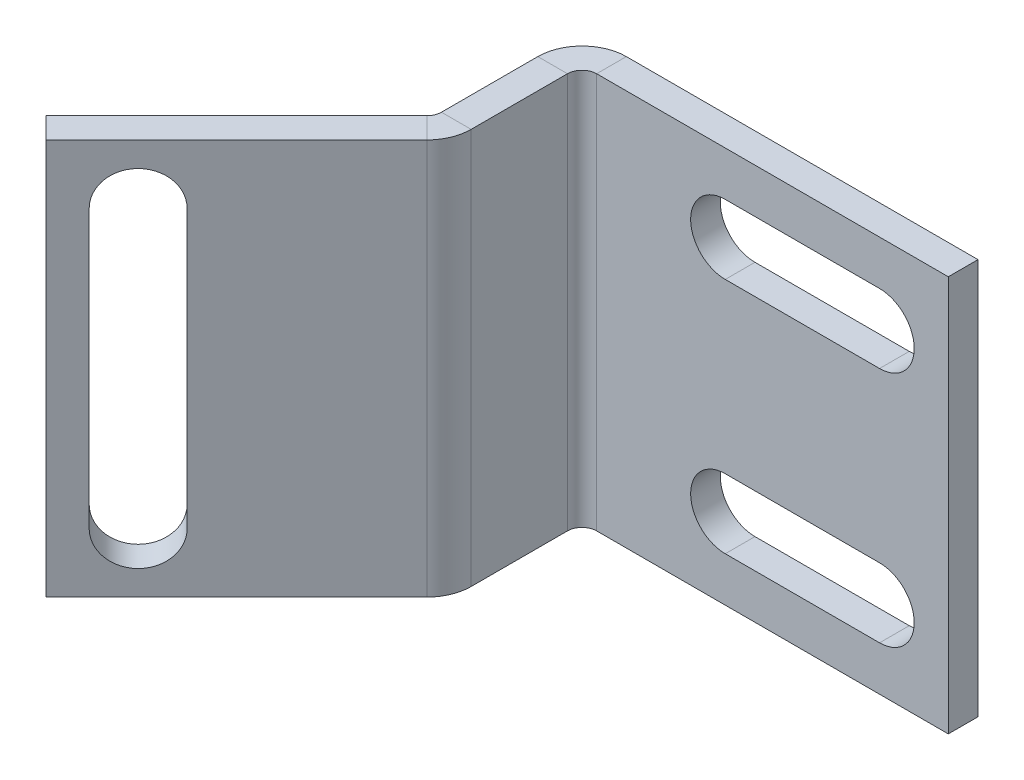
ISO-10303-21;
HEADER;
FILE_DESCRIPTION(('STEP AP214'),'2;1');
FILE_NAME('part.step','',(''),(''),'','','');
FILE_SCHEMA(('AUTOMOTIVE_DESIGN { 1 0 10303 214 1 1 1 1 }'));
ENDSEC;
DATA;
#1=APPLICATION_CONTEXT('core data for automotive mechanical design processes');
#2=APPLICATION_PROTOCOL_DEFINITION('international standard','automotive_design',2000,#1);
#3=PRODUCT_CONTEXT('',#1,'mechanical');
#4=PRODUCT('Part','Part','',(#3));
#5=PRODUCT_RELATED_PRODUCT_CATEGORY('part','',(#4));
#6=PRODUCT_DEFINITION_FORMATION('','',#4);
#7=PRODUCT_DEFINITION_CONTEXT('part definition',#1,'design');
#8=PRODUCT_DEFINITION('design','',#6,#7);
#9=PRODUCT_DEFINITION_SHAPE('','',#8);
#10=(LENGTH_UNIT() NAMED_UNIT(*) SI_UNIT(.MILLI.,.METRE.));
#11=(NAMED_UNIT(*) PLANE_ANGLE_UNIT() SI_UNIT($,.RADIAN.));
#12=(NAMED_UNIT(*) SI_UNIT($,.STERADIAN.) SOLID_ANGLE_UNIT());
#13=UNCERTAINTY_MEASURE_WITH_UNIT(LENGTH_MEASURE(1.E-05),#10,'distance_accuracy_value','');
#14=(GEOMETRIC_REPRESENTATION_CONTEXT(3) GLOBAL_UNCERTAINTY_ASSIGNED_CONTEXT((#13)) GLOBAL_UNIT_ASSIGNED_CONTEXT((#10,
#11,#12)) REPRESENTATION_CONTEXT('',''));
#15=CARTESIAN_POINT('',(0.,0.,0.));
#16=DIRECTION('',(0.,0.,1.));
#17=DIRECTION('',(1.,0.,0.));
#18=AXIS2_PLACEMENT_3D('',#15,#16,#17);
#19=CARTESIAN_POINT('',(-5.80838323353293,3.26347305389222,0.));
#20=DIRECTION('',(0.,-1.,0.));
#21=DIRECTION('',(1.,0.,0.));
#22=AXIS2_PLACEMENT_3D('',#19,#20,#21);
#23=PLANE('',#22);
#24=DIRECTION('',(1.,0.,0.));
#25=VECTOR('',#24,1.);
#26=CARTESIAN_POINT('',(-5.80838323353294,3.26347305389221,5.60356994639633));
#27=LINE('',#26,#25);
#28=CARTESIAN_POINT('',(-5.80838323353294,3.26347305389221,5.60356994639633));
#29=VERTEX_POINT('',#28);
#30=CARTESIAN_POINT('',(-4.30838323353294,3.26347305389221,5.60356994639633));
#31=VERTEX_POINT('',#30);
#32=EDGE_CURVE('E352',#29,#31,#27,.T.);
#33=ORIENTED_EDGE('',*,*,#32,.T.);
#34=DIRECTION('',(0.,0.,1.));
#35=VECTOR('',#34,1.);
#36=CARTESIAN_POINT('',(-4.30838323353293,3.26347305389222,0.));
#37=LINE('',#36,#35);
#38=CARTESIAN_POINT('',(-4.30838323353293,3.26347305389222,0.736599999999997));
#39=VERTEX_POINT('',#38);
#40=EDGE_CURVE('E377',#31,#39,#37,.F.);
#41=ORIENTED_EDGE('',*,*,#40,.T.);
#42=DIRECTION('',(1.,0.,0.));
#43=VECTOR('',#42,1.);
#44=CARTESIAN_POINT('',(-5.80838323353293,3.26347305389222,0.736599999999992));
#45=LINE('',#44,#43);
#46=CARTESIAN_POINT('',(-5.80838323353293,3.26347305389222,0.736599999999992));
#47=VERTEX_POINT('',#46);
#48=EDGE_CURVE('E365',#39,#47,#45,.F.);
#49=ORIENTED_EDGE('',*,*,#48,.T.);
#50=DIRECTION('',(0.,0.,-1.));
#51=VECTOR('',#50,1.);
#52=CARTESIAN_POINT('',(-5.80838323353293,3.26347305389222,0.));
#53=LINE('',#52,#51);
#54=EDGE_CURVE('E372',#29,#47,#53,.T.);
#55=ORIENTED_EDGE('',*,*,#54,.F.);
#56=EDGE_LOOP('',(#33,#41,#49,#55));
#57=FACE_BOUND('',#56,.T.);
#58=ADVANCED_FACE('F77',(#57),#23,.F.);
#59=CARTESIAN_POINT('',(-5.80838323353296,-16.7365269461078,8.03));
#60=DIRECTION('',(0.,1.,0.));
#61=DIRECTION('',(-1.,0.,0.));
#62=AXIS2_PLACEMENT_3D('',#59,#60,#61);
#63=PLANE('',#62);
#64=DIRECTION('',(1.,0.,0.));
#65=VECTOR('',#64,1.);
#66=CARTESIAN_POINT('',(-5.80838323353294,-16.7365269461078,5.60356994639633));
#67=LINE('',#66,#65);
#68=CARTESIAN_POINT('',(-5.80838323353294,-16.7365269461078,5.60356994639633));
#69=VERTEX_POINT('',#68);
#70=CARTESIAN_POINT('',(-4.30838323353295,-16.7365269461078,5.60356994639633));
#71=VERTEX_POINT('',#70);
#72=EDGE_CURVE('E362',#69,#71,#67,.T.);
#73=ORIENTED_EDGE('',*,*,#72,.F.);
#74=DIRECTION('',(0.,0.,1.));
#75=VECTOR('',#74,1.);
#76=CARTESIAN_POINT('',(-5.80838323353293,-16.7365269461078,0.));
#77=LINE('',#76,#75);
#78=CARTESIAN_POINT('',(-5.80838323353293,-16.7365269461078,0.736599999999991));
#79=VERTEX_POINT('',#78);
#80=EDGE_CURVE('E368',#79,#69,#77,.T.);
#81=ORIENTED_EDGE('',*,*,#80,.F.);
#82=DIRECTION('',(1.,0.,0.));
#83=VECTOR('',#82,1.);
#84=CARTESIAN_POINT('',(-4.30838323353293,-16.7365269461078,0.736599999999996));
#85=LINE('',#84,#83);
#86=CARTESIAN_POINT('',(-4.30838323353293,-16.7365269461078,0.736599999999996));
#87=VERTEX_POINT('',#86);
#88=EDGE_CURVE('E382',#87,#79,#85,.F.);
#89=ORIENTED_EDGE('',*,*,#88,.F.);
#90=DIRECTION('',(0.,0.,-1.));
#91=VECTOR('',#90,1.);
#92=CARTESIAN_POINT('',(-4.30838323353295,-16.7365269461078,8.03));
#93=LINE('',#92,#91);
#94=EDGE_CURVE('E374',#87,#71,#93,.F.);
#95=ORIENTED_EDGE('',*,*,#94,.T.);
#96=EDGE_LOOP('',(#73,#81,#89,#95));
#97=FACE_BOUND('',#96,.T.);
#98=ADVANCED_FACE('F498',(#97),#63,.F.);
#99=CARTESIAN_POINT('',(-5.80838323353293,0.,0.));
#100=DIRECTION('',(1.,0.,0.));
#101=DIRECTION('',(0.,0.,-1.));
#102=AXIS2_PLACEMENT_3D('',#99,#100,#101);
#103=PLANE('',#102);
#104=DIRECTION('',(0.,1.,0.));
#105=VECTOR('',#104,1.);
#106=CARTESIAN_POINT('',(-5.80838323353294,3.26347305389222,5.60356994639633));
#107=LINE('',#106,#105);
#108=EDGE_CURVE('E358',#29,#69,#107,.F.);
#109=ORIENTED_EDGE('',*,*,#108,.F.);
#110=ORIENTED_EDGE('',*,*,#54,.T.);
#111=DIRECTION('',(0.,-1.,0.));
#112=VECTOR('',#111,1.);
#113=CARTESIAN_POINT('',(-5.80838323353293,3.26347305389222,0.736599999999992));
#114=LINE('',#113,#112);
#115=EDGE_CURVE('E379',#79,#47,#114,.F.);
#116=ORIENTED_EDGE('',*,*,#115,.F.);
#117=ORIENTED_EDGE('',*,*,#80,.T.);
#118=EDGE_LOOP('',(#109,#110,#116,#117));
#119=FACE_BOUND('',#118,.T.);
#120=ADVANCED_FACE('F493',(#119),#103,.F.);
#121=CARTESIAN_POINT('',(-4.30838323353293,0.,0.));
#122=DIRECTION('',(1.,0.,0.));
#123=DIRECTION('',(0.,0.,-1.));
#124=AXIS2_PLACEMENT_3D('',#121,#122,#123);
#125=PLANE('',#124);
#126=ORIENTED_EDGE('',*,*,#40,.F.);
#127=DIRECTION('',(0.,1.,0.));
#128=VECTOR('',#127,1.);
#129=CARTESIAN_POINT('',(-4.30838323353294,3.26347305389222,5.60356994639633));
#130=LINE('',#129,#128);
#131=EDGE_CURVE('E345',#31,#71,#130,.F.);
#132=ORIENTED_EDGE('',*,*,#131,.T.);
#133=ORIENTED_EDGE('',*,*,#94,.F.);
#134=DIRECTION('',(0.,-1.,0.));
#135=VECTOR('',#134,1.);
#136=CARTESIAN_POINT('',(-4.30838323353293,3.26347305389222,0.736599999999997));
#137=LINE('',#136,#135);
#138=EDGE_CURVE('E385',#39,#87,#137,.T.);
#139=ORIENTED_EDGE('',*,*,#138,.F.);
#140=EDGE_LOOP('',(#126,#132,#133,#139));
#141=FACE_BOUND('',#140,.T.);
#142=ADVANCED_FACE('F505',(#141),#125,.T.);
#143=CARTESIAN_POINT('',(-5.80838323353293,-16.7365269461078,-1.5));
#144=DIRECTION('',(0.,-1.,0.));
#145=DIRECTION('',(0.,0.,-1.));
#146=AXIS2_PLACEMENT_3D('',#143,#144,#145);
#147=PLANE('',#146);
#148=DIRECTION('',(1.,0.,0.));
#149=VECTOR('',#148,1.);
#150=CARTESIAN_POINT('',(-5.80838323353293,-16.7365269461078,0.));
#151=LINE('',#150,#149);
#152=CARTESIAN_POINT('',(-3.57178323353293,-16.7365269461078,0.));
#153=VERTEX_POINT('',#152);
#154=CARTESIAN_POINT('',(14.1916167664671,-16.7365269461078,0.));
#155=VERTEX_POINT('',#154);
#156=EDGE_CURVE('E409',#153,#155,#151,.T.);
#157=ORIENTED_EDGE('',*,*,#156,.F.);
#158=DIRECTION('',(0.,0.,-1.));
#159=VECTOR('',#158,1.);
#160=CARTESIAN_POINT('',(-3.57178323353293,-16.7365269461078,0.));
#161=LINE('',#160,#159);
#162=CARTESIAN_POINT('',(-3.57178323353293,-16.7365269461078,-1.5));
#163=VERTEX_POINT('',#162);
#164=EDGE_CURVE('E395',#153,#163,#161,.T.);
#165=ORIENTED_EDGE('',*,*,#164,.T.);
#166=DIRECTION('',(1.,0.,0.));
#167=VECTOR('',#166,1.);
#168=CARTESIAN_POINT('',(-5.80838323353293,-16.7365269461078,-1.5));
#169=LINE('',#168,#167);
#170=CARTESIAN_POINT('',(14.1916167664671,-16.7365269461078,-1.5));
#171=VERTEX_POINT('',#170);
#172=EDGE_CURVE('E412',#163,#171,#169,.T.);
#173=ORIENTED_EDGE('',*,*,#172,.T.);
#174=DIRECTION('',(0.,0.,1.));
#175=VECTOR('',#174,1.);
#176=CARTESIAN_POINT('',(14.1916167664671,-16.7365269461078,-1.5));
#177=LINE('',#176,#175);
#178=EDGE_CURVE('E421',#171,#155,#177,.T.);
#179=ORIENTED_EDGE('',*,*,#178,.T.);
#180=EDGE_LOOP('',(#157,#165,#173,#179));
#181=FACE_BOUND('',#180,.T.);
#182=ADVANCED_FACE('F79',(#181),#147,.T.);
#183=CARTESIAN_POINT('',(0.,0.,-1.5));
#184=DIRECTION('',(0.,0.,1.));
#185=DIRECTION('',(1.,0.,0.));
#186=AXIS2_PLACEMENT_3D('',#183,#184,#185);
#187=PLANE('',#186);
#188=DIRECTION('',(1.,0.,0.));
#189=VECTOR('',#188,1.);
#190=CARTESIAN_POINT('',(2.92555528243981,1.01347305389222,-1.5));
#191=LINE('',#190,#189);
#192=CARTESIAN_POINT('',(2.92555528243981,1.01347305389222,-1.5));
#193=VERTEX_POINT('',#192);
#194=CARTESIAN_POINT('',(10.7192984695362,1.01347305389221,-1.5));
#195=VERTEX_POINT('',#194);
#196=EDGE_CURVE('E276',#193,#195,#191,.T.);
#197=ORIENTED_EDGE('',*,*,#196,.F.);
#198=CARTESIAN_POINT('',(2.92555528243981,-0.736526946107784,-1.5));
#199=DIRECTION('',(0.,0.,-1.));
#200=DIRECTION('',(-1.,0.,0.));
#201=AXIS2_PLACEMENT_3D('',#198,#199,#200);
#202=CIRCLE('',#201,1.75);
#203=CARTESIAN_POINT('',(2.92555528243981,-2.48652694610778,-1.5));
#204=VERTEX_POINT('',#203);
#205=EDGE_CURVE('E274',#204,#193,#202,.T.);
#206=ORIENTED_EDGE('',*,*,#205,.F.);
#207=DIRECTION('',(-1.,0.,0.));
#208=VECTOR('',#207,1.);
#209=CARTESIAN_POINT('',(2.92555528243981,-2.48652694610778,-1.5));
#210=LINE('',#209,#208);
#211=CARTESIAN_POINT('',(10.7192984695362,-2.48652694610778,-1.5));
#212=VERTEX_POINT('',#211);
#213=EDGE_CURVE('E282',#212,#204,#210,.T.);
#214=ORIENTED_EDGE('',*,*,#213,.F.);
#215=CARTESIAN_POINT('',(10.7192984695362,-0.736526946107785,-1.5));
#216=DIRECTION('',(0.,0.,-1.));
#217=DIRECTION('',(-1.,0.,0.));
#218=AXIS2_PLACEMENT_3D('',#215,#216,#217);
#219=CIRCLE('',#218,1.75);
#220=EDGE_CURVE('E279',#195,#212,#219,.T.);
#221=ORIENTED_EDGE('',*,*,#220,.F.);
#222=EDGE_LOOP('',(#197,#206,#214,#221));
#223=FACE_BOUND('',#222,.T.);
#224=DIRECTION('',(1.,0.,0.));
#225=VECTOR('',#224,1.);
#226=CARTESIAN_POINT('',(2.92555528243981,-10.9865269461078,-1.5));
#227=LINE('',#226,#225);
#228=CARTESIAN_POINT('',(2.92555528243981,-10.9865269461078,-1.5));
#229=VERTEX_POINT('',#228);
#230=CARTESIAN_POINT('',(10.7192984695362,-10.9865269461078,-1.5));
#231=VERTEX_POINT('',#230);
#232=EDGE_CURVE('E296',#229,#231,#227,.T.);
#233=ORIENTED_EDGE('',*,*,#232,.F.);
#234=CARTESIAN_POINT('',(2.92555528243981,-12.7365269461078,-1.5));
#235=DIRECTION('',(0.,0.,-1.));
#236=DIRECTION('',(-1.,0.,0.));
#237=AXIS2_PLACEMENT_3D('',#234,#235,#236);
#238=CIRCLE('',#237,1.75);
#239=CARTESIAN_POINT('',(2.92555528243981,-14.4865269461078,-1.5));
#240=VERTEX_POINT('',#239);
#241=EDGE_CURVE('E288',#240,#229,#238,.T.);
#242=ORIENTED_EDGE('',*,*,#241,.F.);
#243=DIRECTION('',(-1.,0.,0.));
#244=VECTOR('',#243,1.);
#245=CARTESIAN_POINT('',(2.92555528243981,-14.4865269461078,-1.5));
#246=LINE('',#245,#244);
#247=CARTESIAN_POINT('',(10.7192984695362,-14.4865269461078,-1.5));
#248=VERTEX_POINT('',#247);
#249=EDGE_CURVE('E302',#248,#240,#246,.T.);
#250=ORIENTED_EDGE('',*,*,#249,.F.);
#251=CARTESIAN_POINT('',(10.7192984695362,-12.7365269461078,-1.5));
#252=DIRECTION('',(0.,0.,-1.));
#253=DIRECTION('',(-1.,0.,0.));
#254=AXIS2_PLACEMENT_3D('',#251,#252,#253);
#255=CIRCLE('',#254,1.75);
#256=EDGE_CURVE('E299',#231,#248,#255,.T.);
#257=ORIENTED_EDGE('',*,*,#256,.F.);
#258=EDGE_LOOP('',(#233,#242,#250,#257));
#259=FACE_BOUND('',#258,.T.);
#260=DIRECTION('',(0.,-1.,0.));
#261=VECTOR('',#260,1.);
#262=CARTESIAN_POINT('',(-3.57178323353293,-16.7365269461078,-1.5));
#263=LINE('',#262,#261);
#264=CARTESIAN_POINT('',(-3.57178323353293,3.26347305389223,-1.5));
#265=VERTEX_POINT('',#264);
#266=EDGE_CURVE('E389',#163,#265,#263,.F.);
#267=ORIENTED_EDGE('',*,*,#266,.T.);
#268=DIRECTION('',(-1.,0.,0.));
#269=VECTOR('',#268,1.);
#270=CARTESIAN_POINT('',(-5.80838323353293,3.26347305389222,-1.5));
#271=LINE('',#270,#269);
#272=CARTESIAN_POINT('',(14.1916167664671,3.26347305389222,-1.5));
#273=VERTEX_POINT('',#272);
#274=EDGE_CURVE('E418',#273,#265,#271,.T.);
#275=ORIENTED_EDGE('',*,*,#274,.F.);
#276=DIRECTION('',(0.,1.,0.));
#277=VECTOR('',#276,1.);
#278=CARTESIAN_POINT('',(14.1916167664671,3.26347305389222,-1.5));
#279=LINE('',#278,#277);
#280=EDGE_CURVE('E414',#171,#273,#279,.T.);
#281=ORIENTED_EDGE('',*,*,#280,.F.);
#282=ORIENTED_EDGE('',*,*,#172,.F.);
#283=EDGE_LOOP('',(#267,#275,#281,#282));
#284=FACE_BOUND('',#283,.T.);
#285=ADVANCED_FACE('F468',(#223,#259,#284),#187,.F.);
#286=CARTESIAN_POINT('',(0.,0.,0.));
#287=DIRECTION('',(0.,0.,1.));
#288=DIRECTION('',(1.,0.,0.));
#289=AXIS2_PLACEMENT_3D('',#286,#287,#288);
#290=PLANE('',#289);
#291=CARTESIAN_POINT('',(2.92555528243981,-0.736526946107784,0.));
#292=DIRECTION('',(0.,0.,1.));
#293=DIRECTION('',(1.,0.,0.));
#294=AXIS2_PLACEMENT_3D('',#291,#292,#293);
#295=CIRCLE('',#294,1.75);
#296=CARTESIAN_POINT('',(2.92555528243981,1.01347305389222,0.));
#297=VERTEX_POINT('',#296);
#298=CARTESIAN_POINT('',(2.92555528243981,-2.48652694610778,0.));
#299=VERTEX_POINT('',#298);
#300=EDGE_CURVE('E13',#297,#299,#295,.T.);
#301=ORIENTED_EDGE('',*,*,#300,.F.);
#302=DIRECTION('',(-1.,0.,0.));
#303=VECTOR('',#302,1.);
#304=CARTESIAN_POINT('',(0.,1.01347305389222,0.));
#305=LINE('',#304,#303);
#306=CARTESIAN_POINT('',(10.7192984695362,1.01347305389221,0.));
#307=VERTEX_POINT('',#306);
#308=EDGE_CURVE('E441',#307,#297,#305,.T.);
#309=ORIENTED_EDGE('',*,*,#308,.F.);
#310=CARTESIAN_POINT('',(10.7192984695362,-0.736526946107785,0.));
#311=DIRECTION('',(0.,0.,1.));
#312=DIRECTION('',(1.,0.,0.));
#313=AXIS2_PLACEMENT_3D('',#310,#311,#312);
#314=CIRCLE('',#313,1.75);
#315=CARTESIAN_POINT('',(10.7192984695362,-2.48652694610778,0.));
#316=VERTEX_POINT('',#315);
#317=EDGE_CURVE('E443',#316,#307,#314,.T.);
#318=ORIENTED_EDGE('',*,*,#317,.F.);
#319=DIRECTION('',(1.,0.,0.));
#320=VECTOR('',#319,1.);
#321=CARTESIAN_POINT('',(0.,-2.48652694610778,0.));
#322=LINE('',#321,#320);
#323=EDGE_CURVE('E85',#299,#316,#322,.T.);
#324=ORIENTED_EDGE('',*,*,#323,.F.);
#325=EDGE_LOOP('',(#301,#309,#318,#324));
#326=FACE_BOUND('',#325,.T.);
#327=CARTESIAN_POINT('',(2.92555528243981,-12.7365269461078,0.));
#328=DIRECTION('',(0.,0.,1.));
#329=DIRECTION('',(1.,0.,0.));
#330=AXIS2_PLACEMENT_3D('',#327,#328,#329);
#331=CIRCLE('',#330,1.75);
#332=CARTESIAN_POINT('',(2.92555528243981,-10.9865269461078,0.));
#333=VERTEX_POINT('',#332);
#334=CARTESIAN_POINT('',(2.92555528243981,-14.4865269461078,0.));
#335=VERTEX_POINT('',#334);
#336=EDGE_CURVE('E439',#333,#335,#331,.T.);
#337=ORIENTED_EDGE('',*,*,#336,.F.);
#338=DIRECTION('',(-1.,0.,0.));
#339=VECTOR('',#338,1.);
#340=CARTESIAN_POINT('',(0.,-10.9865269461078,0.));
#341=LINE('',#340,#339);
#342=CARTESIAN_POINT('',(10.7192984695362,-10.9865269461078,0.));
#343=VERTEX_POINT('',#342);
#344=EDGE_CURVE('E430',#343,#333,#341,.T.);
#345=ORIENTED_EDGE('',*,*,#344,.F.);
#346=CARTESIAN_POINT('',(10.7192984695362,-12.7365269461078,0.));
#347=DIRECTION('',(0.,0.,1.));
#348=DIRECTION('',(1.,0.,0.));
#349=AXIS2_PLACEMENT_3D('',#346,#347,#348);
#350=CIRCLE('',#349,1.75);
#351=CARTESIAN_POINT('',(10.7192984695362,-14.4865269461078,0.));
#352=VERTEX_POINT('',#351);
#353=EDGE_CURVE('E434',#352,#343,#350,.T.);
#354=ORIENTED_EDGE('',*,*,#353,.F.);
#355=DIRECTION('',(1.,0.,0.));
#356=VECTOR('',#355,1.);
#357=CARTESIAN_POINT('',(0.,-14.4865269461078,0.));
#358=LINE('',#357,#356);
#359=EDGE_CURVE('E437',#335,#352,#358,.T.);
#360=ORIENTED_EDGE('',*,*,#359,.F.);
#361=EDGE_LOOP('',(#337,#345,#354,#360));
#362=FACE_BOUND('',#361,.T.);
#363=DIRECTION('',(-1.,0.,0.));
#364=VECTOR('',#363,1.);
#365=CARTESIAN_POINT('',(-5.80838323353293,3.26347305389222,0.));
#366=LINE('',#365,#364);
#367=CARTESIAN_POINT('',(14.1916167664671,3.26347305389222,0.));
#368=VERTEX_POINT('',#367);
#369=CARTESIAN_POINT('',(-3.57178323353293,3.26347305389222,0.));
#370=VERTEX_POINT('',#369);
#371=EDGE_CURVE('E415',#368,#370,#366,.T.);
#372=ORIENTED_EDGE('',*,*,#371,.T.);
#373=DIRECTION('',(0.,-1.,0.));
#374=VECTOR('',#373,1.);
#375=CARTESIAN_POINT('',(-3.57178323353293,-16.7365269461078,0.));
#376=LINE('',#375,#374);
#377=EDGE_CURVE('E401',#153,#370,#376,.F.);
#378=ORIENTED_EDGE('',*,*,#377,.F.);
#379=ORIENTED_EDGE('',*,*,#156,.T.);
#380=DIRECTION('',(0.,1.,0.));
#381=VECTOR('',#380,1.);
#382=CARTESIAN_POINT('',(14.1916167664671,3.26347305389222,0.));
#383=LINE('',#382,#381);
#384=EDGE_CURVE('E423',#155,#368,#383,.T.);
#385=ORIENTED_EDGE('',*,*,#384,.T.);
#386=EDGE_LOOP('',(#372,#378,#379,#385));
#387=FACE_BOUND('',#386,.T.);
#388=ADVANCED_FACE('F458',(#326,#362,#387),#290,.T.);
#389=CARTESIAN_POINT('',(-5.80838323353293,3.26347305389222,-1.5));
#390=DIRECTION('',(0.,1.,0.));
#391=DIRECTION('',(0.,0.,1.));
#392=AXIS2_PLACEMENT_3D('',#389,#390,#391);
#393=PLANE('',#392);
#394=DIRECTION('',(0.,0.,-1.));
#395=VECTOR('',#394,1.);
#396=CARTESIAN_POINT('',(-3.57178323353293,3.26347305389222,0.));
#397=LINE('',#396,#395);
#398=EDGE_CURVE('E406',#370,#265,#397,.T.);
#399=ORIENTED_EDGE('',*,*,#398,.F.);
#400=ORIENTED_EDGE('',*,*,#371,.F.);
#401=DIRECTION('',(0.,0.,1.));
#402=VECTOR('',#401,1.);
#403=CARTESIAN_POINT('',(14.1916167664671,3.26347305389222,-1.5));
#404=LINE('',#403,#402);
#405=EDGE_CURVE('E428',#273,#368,#404,.T.);
#406=ORIENTED_EDGE('',*,*,#405,.F.);
#407=ORIENTED_EDGE('',*,*,#274,.T.);
#408=EDGE_LOOP('',(#399,#400,#406,#407));
#409=FACE_BOUND('',#408,.T.);
#410=ADVANCED_FACE('F482',(#409),#393,.T.);
#411=CARTESIAN_POINT('',(14.1916167664671,3.26347305389222,-1.5));
#412=DIRECTION('',(1.,0.,0.));
#413=DIRECTION('',(0.,1.,0.));
#414=AXIS2_PLACEMENT_3D('',#411,#412,#413);
#415=PLANE('',#414);
#416=ORIENTED_EDGE('',*,*,#384,.F.);
#417=ORIENTED_EDGE('',*,*,#178,.F.);
#418=ORIENTED_EDGE('',*,*,#280,.T.);
#419=ORIENTED_EDGE('',*,*,#405,.T.);
#420=EDGE_LOOP('',(#416,#417,#418,#419));
#421=FACE_BOUND('',#420,.T.);
#422=ADVANCED_FACE('F533',(#421),#415,.T.);
#423=CARTESIAN_POINT('',(-3.57178323353293,3.26347305389222,0.7366));
#424=DIRECTION('',(0.,1.,0.));
#425=DIRECTION('',(0.,0.,1.));
#426=AXIS2_PLACEMENT_3D('',#423,#424,#425);
#427=PLANE('',#426);
#428=ORIENTED_EDGE('',*,*,#48,.F.);
#429=CARTESIAN_POINT('',(-3.57178323353293,3.26347305389222,0.7366));
#430=DIRECTION('',(0.,-1.,0.));
#431=DIRECTION('',(0.,0.,-1.));
#432=AXIS2_PLACEMENT_3D('',#429,#430,#431);
#433=CIRCLE('',#432,0.7366);
#434=EDGE_CURVE('E398',#370,#39,#433,.F.);
#435=ORIENTED_EDGE('',*,*,#434,.F.);
#436=ORIENTED_EDGE('',*,*,#398,.T.);
#437=CARTESIAN_POINT('',(-3.57178323353293,3.26347305389222,0.7366));
#438=DIRECTION('',(0.,-1.,0.));
#439=DIRECTION('',(0.,0.,-1.));
#440=AXIS2_PLACEMENT_3D('',#437,#438,#439);
#441=CIRCLE('',#440,2.2366);
#442=EDGE_CURVE('E391',#265,#47,#441,.F.);
#443=ORIENTED_EDGE('',*,*,#442,.T.);
#444=EDGE_LOOP('',(#428,#435,#436,#443));
#445=FACE_BOUND('',#444,.T.);
#446=ADVANCED_FACE('F487',(#445),#427,.T.);
#447=CARTESIAN_POINT('',(-3.57178323353293,-16.7365269461078,0.736599999999998));
#448=DIRECTION('',(0.,1.,0.));
#449=DIRECTION('',(0.,0.,1.));
#450=AXIS2_PLACEMENT_3D('',#447,#448,#449);
#451=PLANE('',#450);
#452=CARTESIAN_POINT('',(-3.57178323353293,-16.7365269461078,0.736599999999998));
#453=DIRECTION('',(0.,-1.,0.));
#454=DIRECTION('',(0.,0.,-1.));
#455=AXIS2_PLACEMENT_3D('',#452,#453,#454);
#456=CIRCLE('',#455,0.7366);
#457=EDGE_CURVE('E371',#87,#153,#456,.T.);
#458=ORIENTED_EDGE('',*,*,#457,.F.);
#459=ORIENTED_EDGE('',*,*,#88,.T.);
#460=CARTESIAN_POINT('',(-3.57178323353293,-16.7365269461078,0.736599999999998));
#461=DIRECTION('',(0.,-1.,0.));
#462=DIRECTION('',(0.,0.,-1.));
#463=AXIS2_PLACEMENT_3D('',#460,#461,#462);
#464=CIRCLE('',#463,2.2366);
#465=EDGE_CURVE('E392',#79,#163,#464,.T.);
#466=ORIENTED_EDGE('',*,*,#465,.T.);
#467=ORIENTED_EDGE('',*,*,#164,.F.);
#468=EDGE_LOOP('',(#458,#459,#466,#467));
#469=FACE_BOUND('',#468,.T.);
#470=ADVANCED_FACE('F525',(#469),#451,.F.);
#471=CARTESIAN_POINT('',(-3.57178323353293,-16.7365269461078,0.736599999999998));
#472=DIRECTION('',(0.,-1.,0.));
#473=DIRECTION('',(-1.,0.,0.));
#474=AXIS2_PLACEMENT_3D('',#471,#472,#473);
#475=CYLINDRICAL_SURFACE('',#474,2.2366);
#476=ORIENTED_EDGE('',*,*,#266,.F.);
#477=ORIENTED_EDGE('',*,*,#465,.F.);
#478=ORIENTED_EDGE('',*,*,#115,.T.);
#479=ORIENTED_EDGE('',*,*,#442,.F.);
#480=EDGE_LOOP('',(#476,#477,#478,#479));
#481=FACE_BOUND('',#480,.T.);
#482=ADVANCED_FACE('F488',(#481),#475,.T.);
#483=CARTESIAN_POINT('',(-3.57178323353293,-16.7365269461078,0.736599999999998));
#484=DIRECTION('',(0.,-1.,0.));
#485=DIRECTION('',(-1.,0.,0.));
#486=AXIS2_PLACEMENT_3D('',#483,#484,#485);
#487=CYLINDRICAL_SURFACE('',#486,0.7366);
#488=ORIENTED_EDGE('',*,*,#377,.T.);
#489=ORIENTED_EDGE('',*,*,#434,.T.);
#490=ORIENTED_EDGE('',*,*,#138,.T.);
#491=ORIENTED_EDGE('',*,*,#457,.T.);
#492=EDGE_LOOP('',(#488,#489,#490,#491));
#493=FACE_BOUND('',#492,.T.);
#494=ADVANCED_FACE('F516',(#493),#487,.F.);
#495=CARTESIAN_POINT('',(-6.54498323353294,-16.7365269461078,5.60356994639632));
#496=DIRECTION('',(0.,-1.,0.));
#497=DIRECTION('',(0.,0.,-1.));
#498=AXIS2_PLACEMENT_3D('',#495,#496,#497);
#499=PLANE('',#498);
#500=DIRECTION('',(-0.707106781186549,0.,-0.707106781186546));
#501=VECTOR('',#500,1.);
#502=CARTESIAN_POINT('',(-4.96346820673111,-16.7365269461078,7.18508497319815));
#503=LINE('',#502,#501);
#504=CARTESIAN_POINT('',(-6.02412837851093,-16.7365269461078,6.12442480141833));
#505=VERTEX_POINT('',#504);
#506=CARTESIAN_POINT('',(-4.96346820673111,-16.7365269461078,7.18508497319815));
#507=VERTEX_POINT('',#506);
#508=EDGE_CURVE('E308',#505,#507,#503,.F.);
#509=ORIENTED_EDGE('',*,*,#508,.F.);
#510=CARTESIAN_POINT('',(-6.54498323353294,-16.7365269461078,5.60356994639632));
#511=DIRECTION('',(0.,1.,0.));
#512=DIRECTION('',(0.,0.,1.));
#513=AXIS2_PLACEMENT_3D('',#510,#511,#512);
#514=CIRCLE('',#513,0.7366);
#515=EDGE_CURVE('E355',#69,#505,#514,.F.);
#516=ORIENTED_EDGE('',*,*,#515,.F.);
#517=ORIENTED_EDGE('',*,*,#72,.T.);
#518=CARTESIAN_POINT('',(-6.54498323353294,-16.7365269461078,5.60356994639632));
#519=DIRECTION('',(0.,1.,0.));
#520=DIRECTION('',(0.,0.,1.));
#521=AXIS2_PLACEMENT_3D('',#518,#519,#520);
#522=CIRCLE('',#521,2.2366);
#523=EDGE_CURVE('E348',#71,#507,#522,.F.);
#524=ORIENTED_EDGE('',*,*,#523,.T.);
#525=EDGE_LOOP('',(#509,#516,#517,#524));
#526=FACE_BOUND('',#525,.T.);
#527=ADVANCED_FACE('F502',(#526),#499,.T.);
#528=CARTESIAN_POINT('',(-6.54498323353294,3.26347305389221,5.60356994639632));
#529=DIRECTION('',(0.,-1.,0.));
#530=DIRECTION('',(0.,0.,-1.));
#531=AXIS2_PLACEMENT_3D('',#528,#529,#530);
#532=PLANE('',#531);
#533=CARTESIAN_POINT('',(-6.54498323353294,3.26347305389221,5.60356994639632));
#534=DIRECTION('',(0.,1.,0.));
#535=DIRECTION('',(0.,0.,1.));
#536=AXIS2_PLACEMENT_3D('',#533,#534,#535);
#537=CIRCLE('',#536,0.7366);
#538=CARTESIAN_POINT('',(-6.02412837851093,3.26347305389221,6.12442480141833));
#539=VERTEX_POINT('',#538);
#540=EDGE_CURVE('E318',#539,#29,#537,.T.);
#541=ORIENTED_EDGE('',*,*,#540,.F.);
#542=DIRECTION('',(-0.707106781186549,0.,-0.707106781186546));
#543=VECTOR('',#542,1.);
#544=CARTESIAN_POINT('',(-6.02412837851093,3.26347305389222,6.12442480141833));
#545=LINE('',#544,#543);
#546=CARTESIAN_POINT('',(-4.96346820673111,3.26347305389222,7.18508497319815));
#547=VERTEX_POINT('',#546);
#548=EDGE_CURVE('E338',#539,#547,#545,.F.);
#549=ORIENTED_EDGE('',*,*,#548,.T.);
#550=CARTESIAN_POINT('',(-6.54498323353294,3.26347305389221,5.60356994639632));
#551=DIRECTION('',(0.,1.,0.));
#552=DIRECTION('',(0.,0.,1.));
#553=AXIS2_PLACEMENT_3D('',#550,#551,#552);
#554=CIRCLE('',#553,2.2366);
#555=EDGE_CURVE('E349',#547,#31,#554,.T.);
#556=ORIENTED_EDGE('',*,*,#555,.T.);
#557=ORIENTED_EDGE('',*,*,#32,.F.);
#558=EDGE_LOOP('',(#541,#549,#556,#557));
#559=FACE_BOUND('',#558,.T.);
#560=ADVANCED_FACE('F511',(#559),#532,.F.);
#561=CARTESIAN_POINT('',(-6.54498323353294,3.26347305389222,5.60356994639632));
#562=DIRECTION('',(0.,1.,0.));
#563=DIRECTION('',(0.707106781186549,0.,0.707106781186546));
#564=AXIS2_PLACEMENT_3D('',#561,#562,#563);
#565=CYLINDRICAL_SURFACE('',#564,2.2366);
#566=ORIENTED_EDGE('',*,*,#131,.F.);
#567=ORIENTED_EDGE('',*,*,#555,.F.);
#568=DIRECTION('',(0.,1.,0.));
#569=VECTOR('',#568,1.);
#570=CARTESIAN_POINT('',(-4.96346820673111,-16.7365269461078,7.18508497319815));
#571=LINE('',#570,#569);
#572=EDGE_CURVE('E336',#547,#507,#571,.F.);
#573=ORIENTED_EDGE('',*,*,#572,.T.);
#574=ORIENTED_EDGE('',*,*,#523,.F.);
#575=EDGE_LOOP('',(#566,#567,#573,#574));
#576=FACE_BOUND('',#575,.T.);
#577=ADVANCED_FACE('F508',(#576),#565,.T.);
#578=CARTESIAN_POINT('',(-6.54498323353294,3.26347305389222,5.60356994639632));
#579=DIRECTION('',(0.,1.,0.));
#580=DIRECTION('',(0.707106781186549,0.,0.707106781186546));
#581=AXIS2_PLACEMENT_3D('',#578,#579,#580);
#582=CYLINDRICAL_SURFACE('',#581,0.7366);
#583=ORIENTED_EDGE('',*,*,#108,.T.);
#584=ORIENTED_EDGE('',*,*,#515,.T.);
#585=DIRECTION('',(0.,1.,0.));
#586=VECTOR('',#585,1.);
#587=CARTESIAN_POINT('',(-6.02412837851093,-16.7365269461078,6.12442480141833));
#588=LINE('',#587,#586);
#589=EDGE_CURVE('E341',#505,#539,#588,.T.);
#590=ORIENTED_EDGE('',*,*,#589,.T.);
#591=ORIENTED_EDGE('',*,*,#540,.T.);
#592=EDGE_LOOP('',(#583,#584,#590,#591));
#593=FACE_BOUND('',#592,.T.);
#594=ADVANCED_FACE('F553',(#593),#582,.F.);
#595=CARTESIAN_POINT('',(-4.74772306175312,-16.7365269461078,6.96933982822016));
#596=DIRECTION('',(0.,1.,0.));
#597=DIRECTION('',(-1.,0.,0.));
#598=AXIS2_PLACEMENT_3D('',#595,#596,#597);
#599=PLANE('',#598);
#600=ORIENTED_EDGE('',*,*,#508,.T.);
#601=DIRECTION('',(0.707106781186546,0.,-0.707106781186549));
#602=VECTOR('',#601,1.);
#603=CARTESIAN_POINT('',(2.17146855501334,-16.7365269461078,0.0501482114536756));
#604=LINE('',#603,#602);
#605=CARTESIAN_POINT('',(-14.5826447641735,-16.7365269461078,16.8042615306405));
#606=VERTEX_POINT('',#605);
#607=EDGE_CURVE('E326',#606,#507,#604,.T.);
#608=ORIENTED_EDGE('',*,*,#607,.F.);
#609=DIRECTION('',(-0.707106781186549,0.,-0.707106781186546));
#610=VECTOR('',#609,1.);
#611=CARTESIAN_POINT('',(-14.5826447641735,-16.7365269461078,16.8042615306405));
#612=LINE('',#611,#610);
#613=CARTESIAN_POINT('',(-15.6433049359533,-16.7365269461078,15.7436013588607));
#614=VERTEX_POINT('',#613);
#615=EDGE_CURVE('E319',#606,#614,#612,.T.);
#616=ORIENTED_EDGE('',*,*,#615,.T.);
#617=DIRECTION('',(-0.707106781186546,0.,0.707106781186549));
#618=VECTOR('',#617,1.);
#619=CARTESIAN_POINT('',(-5.80838323353295,-16.7365269461078,5.90867965644035));
#620=LINE('',#619,#618);
#621=EDGE_CURVE('E333',#614,#505,#620,.F.);
#622=ORIENTED_EDGE('',*,*,#621,.T.);
#623=EDGE_LOOP('',(#600,#608,#616,#622));
#624=FACE_BOUND('',#623,.T.);
#625=ADVANCED_FACE('F659',(#624),#599,.F.);
#626=CARTESIAN_POINT('',(-14.5826447641735,3.26347305389222,16.8042615306405));
#627=DIRECTION('',(0.,-1.,0.));
#628=DIRECTION('',(1.,0.,0.));
#629=AXIS2_PLACEMENT_3D('',#626,#627,#628);
#630=PLANE('',#629);
#631=ORIENTED_EDGE('',*,*,#548,.F.);
#632=DIRECTION('',(0.707106781186546,0.,-0.707106781186549));
#633=VECTOR('',#632,1.);
#634=CARTESIAN_POINT('',(-15.6433049359533,3.26347305389222,15.7436013588607));
#635=LINE('',#634,#633);
#636=CARTESIAN_POINT('',(-15.6433049359533,3.26347305389222,15.7436013588607));
#637=VERTEX_POINT('',#636);
#638=EDGE_CURVE('E331',#539,#637,#635,.F.);
#639=ORIENTED_EDGE('',*,*,#638,.T.);
#640=DIRECTION('',(-0.707106781186549,0.,-0.707106781186546));
#641=VECTOR('',#640,1.);
#642=CARTESIAN_POINT('',(-14.5826447641735,3.26347305389222,16.8042615306405));
#643=LINE('',#642,#641);
#644=CARTESIAN_POINT('',(-14.5826447641735,3.26347305389222,16.8042615306405));
#645=VERTEX_POINT('',#644);
#646=EDGE_CURVE('E315',#645,#637,#643,.T.);
#647=ORIENTED_EDGE('',*,*,#646,.F.);
#648=DIRECTION('',(-0.707106781186546,0.,0.707106781186549));
#649=VECTOR('',#648,1.);
#650=CARTESIAN_POINT('',(2.17146855501334,3.26347305389222,0.0501482114536757));
#651=LINE('',#650,#649);
#652=EDGE_CURVE('E324',#547,#645,#651,.T.);
#653=ORIENTED_EDGE('',*,*,#652,.F.);
#654=EDGE_LOOP('',(#631,#639,#647,#653));
#655=FACE_BOUND('',#654,.T.);
#656=ADVANCED_FACE('F669',(#655),#630,.F.);
#657=CARTESIAN_POINT('',(2.17146855501334,0.,0.0501482114536756));
#658=DIRECTION('',(-0.707106781186549,0.,-0.707106781186546));
#659=DIRECTION('',(-0.707106781186546,0.,0.707106781186549));
#660=AXIS2_PLACEMENT_3D('',#657,#658,#659);
#661=PLANE('',#660);
#662=DIRECTION('',(0.,-1.,0.));
#663=VECTOR('',#662,1.);
#664=CARTESIAN_POINT('',(-11.0177869538173,0.,13.2394037202844));
#665=LINE('',#664,#663);
#666=CARTESIAN_POINT('',(-11.0177869538173,0.263473053892216,13.2394037202844));
#667=VERTEX_POINT('',#666);
#668=CARTESIAN_POINT('',(-11.0177869538173,-13.7365269461078,13.2394037202844));
#669=VERTEX_POINT('',#668);
#670=EDGE_CURVE('E268',#667,#669,#665,.T.);
#671=ORIENTED_EDGE('',*,*,#670,.T.);
#672=CARTESIAN_POINT('',(-12.2552238208938,-13.7365269461078,14.4768405873608));
#673=DIRECTION('',(-0.707106781186549,0.,-0.707106781186546));
#674=DIRECTION('',(-0.707106781186546,0.,0.707106781186549));
#675=AXIS2_PLACEMENT_3D('',#672,#673,#674);
#676=CIRCLE('',#675,1.75);
#677=CARTESIAN_POINT('',(-13.4926606879702,-13.7365269461078,15.7142774544373));
#678=VERTEX_POINT('',#677);
#679=EDGE_CURVE('E271',#669,#678,#676,.T.);
#680=ORIENTED_EDGE('',*,*,#679,.T.);
#681=DIRECTION('',(0.,1.,0.));
#682=VECTOR('',#681,1.);
#683=CARTESIAN_POINT('',(-13.4926606879702,0.,15.7142774544373));
#684=LINE('',#683,#682);
#685=CARTESIAN_POINT('',(-13.4926606879702,0.263473053892216,15.7142774544373));
#686=VERTEX_POINT('',#685);
#687=EDGE_CURVE('E263',#678,#686,#684,.T.);
#688=ORIENTED_EDGE('',*,*,#687,.T.);
#689=CARTESIAN_POINT('',(-12.2552238208938,0.263473053892216,14.4768405873608));
#690=DIRECTION('',(-0.707106781186549,0.,-0.707106781186546));
#691=DIRECTION('',(-0.707106781186546,0.,0.707106781186549));
#692=AXIS2_PLACEMENT_3D('',#689,#690,#691);
#693=CIRCLE('',#692,1.75);
#694=EDGE_CURVE('E243',#686,#667,#693,.T.);
#695=ORIENTED_EDGE('',*,*,#694,.T.);
#696=EDGE_LOOP('',(#671,#680,#688,#695));
#697=FACE_BOUND('',#696,.T.);
#698=ORIENTED_EDGE('',*,*,#572,.F.);
#699=ORIENTED_EDGE('',*,*,#652,.T.);
#700=DIRECTION('',(0.,-1.,0.));
#701=VECTOR('',#700,1.);
#702=CARTESIAN_POINT('',(-14.5826447641735,0.,16.8042615306405));
#703=LINE('',#702,#701);
#704=EDGE_CURVE('E322',#645,#606,#703,.T.);
#705=ORIENTED_EDGE('',*,*,#704,.T.);
#706=ORIENTED_EDGE('',*,*,#607,.T.);
#707=EDGE_LOOP('',(#698,#699,#705,#706));
#708=FACE_BOUND('',#707,.T.);
#709=ADVANCED_FACE('F679',(#697,#708),#661,.F.);
#710=CARTESIAN_POINT('',(1.11080838323352,0.,-1.01051196032614));
#711=DIRECTION('',(-0.707106781186549,0.,-0.707106781186546));
#712=DIRECTION('',(-0.707106781186546,0.,0.707106781186549));
#713=AXIS2_PLACEMENT_3D('',#710,#711,#712);
#714=PLANE('',#713);
#715=CARTESIAN_POINT('',(-13.3158839926736,-13.7365269461078,13.416180415581));
#716=DIRECTION('',(-0.707106781186549,0.,-0.707106781186546));
#717=DIRECTION('',(-0.707106781186546,0.,0.707106781186549));
#718=AXIS2_PLACEMENT_3D('',#715,#716,#717);
#719=CIRCLE('',#718,1.75);
#720=CARTESIAN_POINT('',(-12.0784471255971,-13.7365269461078,12.1787435485046));
#721=VERTEX_POINT('',#720);
#722=CARTESIAN_POINT('',(-14.55332085975,-13.7365269461078,14.6536172826575));
#723=VERTEX_POINT('',#722);
#724=EDGE_CURVE('E100',#721,#723,#719,.T.);
#725=ORIENTED_EDGE('',*,*,#724,.F.);
#726=DIRECTION('',(0.,-1.,0.));
#727=VECTOR('',#726,1.);
#728=CARTESIAN_POINT('',(-12.0784471255971,-13.7365269461078,12.1787435485046));
#729=LINE('',#728,#727);
#730=CARTESIAN_POINT('',(-12.0784471255971,0.263473053892216,12.1787435485046));
#731=VERTEX_POINT('',#730);
#732=EDGE_CURVE('E256',#731,#721,#729,.T.);
#733=ORIENTED_EDGE('',*,*,#732,.F.);
#734=CARTESIAN_POINT('',(-13.3158839926736,0.263473053892216,13.416180415581));
#735=DIRECTION('',(-0.707106781186549,0.,-0.707106781186546));
#736=DIRECTION('',(-0.707106781186546,0.,0.707106781186549));
#737=AXIS2_PLACEMENT_3D('',#734,#735,#736);
#738=CIRCLE('',#737,1.75);
#739=CARTESIAN_POINT('',(-14.55332085975,0.263473053892216,14.6536172826575));
#740=VERTEX_POINT('',#739);
#741=EDGE_CURVE('E240',#740,#731,#738,.T.);
#742=ORIENTED_EDGE('',*,*,#741,.F.);
#743=DIRECTION('',(0.,1.,0.));
#744=VECTOR('',#743,1.);
#745=CARTESIAN_POINT('',(-14.5533208597501,-13.7365269461078,14.6536172826575));
#746=LINE('',#745,#744);
#747=EDGE_CURVE('E249',#723,#740,#746,.T.);
#748=ORIENTED_EDGE('',*,*,#747,.F.);
#749=EDGE_LOOP('',(#725,#733,#742,#748));
#750=FACE_BOUND('',#749,.T.);
#751=ORIENTED_EDGE('',*,*,#638,.F.);
#752=ORIENTED_EDGE('',*,*,#589,.F.);
#753=ORIENTED_EDGE('',*,*,#621,.F.);
#754=DIRECTION('',(0.,1.,0.));
#755=VECTOR('',#754,1.);
#756=CARTESIAN_POINT('',(-15.6433049359533,-16.7365269461078,15.7436013588607));
#757=LINE('',#756,#755);
#758=EDGE_CURVE('E329',#637,#614,#757,.F.);
#759=ORIENTED_EDGE('',*,*,#758,.F.);
#760=EDGE_LOOP('',(#751,#752,#753,#759));
#761=FACE_BOUND('',#760,.T.);
#762=ADVANCED_FACE('F253',(#750,#761),#714,.T.);
#763=CARTESIAN_POINT('',(-14.5826447641735,-16.7365269461078,16.8042615306405));
#764=DIRECTION('',(0.707106781186546,0.,-0.707106781186549));
#765=DIRECTION('',(-0.707106781186549,0.,-0.707106781186546));
#766=AXIS2_PLACEMENT_3D('',#763,#764,#765);
#767=PLANE('',#766);
#768=ORIENTED_EDGE('',*,*,#758,.T.);
#769=ORIENTED_EDGE('',*,*,#615,.F.);
#770=ORIENTED_EDGE('',*,*,#704,.F.);
#771=ORIENTED_EDGE('',*,*,#646,.T.);
#772=EDGE_LOOP('',(#768,#769,#770,#771));
#773=FACE_BOUND('',#772,.T.);
#774=ADVANCED_FACE('F688',(#773),#767,.F.);
#775=CARTESIAN_POINT('',(2.92555528243981,-12.7365269461078,16.8042615306405));
#776=DIRECTION('',(0.,0.,-1.));
#777=DIRECTION('',(-1.,0.,0.));
#778=AXIS2_PLACEMENT_3D('',#775,#776,#777);
#779=CYLINDRICAL_SURFACE('',#778,1.75);
#780=ORIENTED_EDGE('',*,*,#336,.T.);
#781=DIRECTION('',(0.,0.,-1.));
#782=VECTOR('',#781,1.);
#783=CARTESIAN_POINT('',(2.92555528243981,-14.4865269461078,16.8042615306405));
#784=LINE('',#783,#782);
#785=EDGE_CURVE('E306',#335,#240,#784,.T.);
#786=ORIENTED_EDGE('',*,*,#785,.T.);
#787=ORIENTED_EDGE('',*,*,#241,.T.);
#788=DIRECTION('',(0.,0.,-1.));
#789=VECTOR('',#788,1.);
#790=CARTESIAN_POINT('',(2.92555528243981,-10.9865269461078,16.8042615306405));
#791=LINE('',#790,#789);
#792=EDGE_CURVE('E305',#333,#229,#791,.T.);
#793=ORIENTED_EDGE('',*,*,#792,.F.);
#794=EDGE_LOOP('',(#780,#786,#787,#793));
#795=FACE_BOUND('',#794,.T.);
#796=ADVANCED_FACE('F692',(#795),#779,.F.);
#797=CARTESIAN_POINT('',(2.92555528243981,-14.4865269461078,16.8042615306405));
#798=DIRECTION('',(0.,-1.,0.));
#799=DIRECTION('',(1.,0.,0.));
#800=AXIS2_PLACEMENT_3D('',#797,#798,#799);
#801=PLANE('',#800);
#802=ORIENTED_EDGE('',*,*,#359,.T.);
#803=DIRECTION('',(0.,0.,-1.));
#804=VECTOR('',#803,1.);
#805=CARTESIAN_POINT('',(10.7192984695362,-14.4865269461078,16.8042615306405));
#806=LINE('',#805,#804);
#807=EDGE_CURVE('E309',#352,#248,#806,.T.);
#808=ORIENTED_EDGE('',*,*,#807,.T.);
#809=ORIENTED_EDGE('',*,*,#249,.T.);
#810=ORIENTED_EDGE('',*,*,#785,.F.);
#811=EDGE_LOOP('',(#802,#808,#809,#810));
#812=FACE_BOUND('',#811,.T.);
#813=ADVANCED_FACE('F707',(#812),#801,.F.);
#814=CARTESIAN_POINT('',(10.7192984695362,-12.7365269461078,16.8042615306405));
#815=DIRECTION('',(0.,0.,-1.));
#816=DIRECTION('',(-1.,0.,0.));
#817=AXIS2_PLACEMENT_3D('',#814,#815,#816);
#818=CYLINDRICAL_SURFACE('',#817,1.75);
#819=ORIENTED_EDGE('',*,*,#353,.T.);
#820=DIRECTION('',(0.,0.,-1.));
#821=VECTOR('',#820,1.);
#822=CARTESIAN_POINT('',(10.7192984695362,-10.9865269461078,16.8042615306405));
#823=LINE('',#822,#821);
#824=EDGE_CURVE('E311',#343,#231,#823,.T.);
#825=ORIENTED_EDGE('',*,*,#824,.T.);
#826=ORIENTED_EDGE('',*,*,#256,.T.);
#827=ORIENTED_EDGE('',*,*,#807,.F.);
#828=EDGE_LOOP('',(#819,#825,#826,#827));
#829=FACE_BOUND('',#828,.T.);
#830=ADVANCED_FACE('F714',(#829),#818,.F.);
#831=CARTESIAN_POINT('',(2.92555528243981,-10.9865269461078,16.8042615306405));
#832=DIRECTION('',(0.,1.,0.));
#833=DIRECTION('',(-1.,0.,0.));
#834=AXIS2_PLACEMENT_3D('',#831,#832,#833);
#835=PLANE('',#834);
#836=ORIENTED_EDGE('',*,*,#344,.T.);
#837=ORIENTED_EDGE('',*,*,#792,.T.);
#838=ORIENTED_EDGE('',*,*,#232,.T.);
#839=ORIENTED_EDGE('',*,*,#824,.F.);
#840=EDGE_LOOP('',(#836,#837,#838,#839));
#841=FACE_BOUND('',#840,.T.);
#842=ADVANCED_FACE('F722',(#841),#835,.F.);
#843=CARTESIAN_POINT('',(2.92555528243981,-0.736526946107784,16.8042615306405));
#844=DIRECTION('',(0.,0.,-1.));
#845=DIRECTION('',(-1.,0.,0.));
#846=AXIS2_PLACEMENT_3D('',#843,#844,#845);
#847=CYLINDRICAL_SURFACE('',#846,1.75);
#848=ORIENTED_EDGE('',*,*,#300,.T.);
#849=DIRECTION('',(0.,0.,-1.));
#850=VECTOR('',#849,1.);
#851=CARTESIAN_POINT('',(2.92555528243981,-2.48652694610778,16.8042615306405));
#852=LINE('',#851,#850);
#853=EDGE_CURVE('E286',#299,#204,#852,.T.);
#854=ORIENTED_EDGE('',*,*,#853,.T.);
#855=ORIENTED_EDGE('',*,*,#205,.T.);
#856=DIRECTION('',(0.,0.,-1.));
#857=VECTOR('',#856,1.);
#858=CARTESIAN_POINT('',(2.92555528243981,1.01347305389222,16.8042615306405));
#859=LINE('',#858,#857);
#860=EDGE_CURVE('E285',#297,#193,#859,.T.);
#861=ORIENTED_EDGE('',*,*,#860,.F.);
#862=EDGE_LOOP('',(#848,#854,#855,#861));
#863=FACE_BOUND('',#862,.T.);
#864=ADVANCED_FACE('F465',(#863),#847,.F.);
#865=CARTESIAN_POINT('',(2.92555528243981,-2.48652694610778,16.8042615306405));
#866=DIRECTION('',(0.,-1.,0.));
#867=DIRECTION('',(1.,0.,0.));
#868=AXIS2_PLACEMENT_3D('',#865,#866,#867);
#869=PLANE('',#868);
#870=ORIENTED_EDGE('',*,*,#323,.T.);
#871=DIRECTION('',(0.,0.,-1.));
#872=VECTOR('',#871,1.);
#873=CARTESIAN_POINT('',(10.7192984695362,-2.48652694610778,16.8042615306405));
#874=LINE('',#873,#872);
#875=EDGE_CURVE('E289',#316,#212,#874,.T.);
#876=ORIENTED_EDGE('',*,*,#875,.T.);
#877=ORIENTED_EDGE('',*,*,#213,.T.);
#878=ORIENTED_EDGE('',*,*,#853,.F.);
#879=EDGE_LOOP('',(#870,#876,#877,#878));
#880=FACE_BOUND('',#879,.T.);
#881=ADVANCED_FACE('F449',(#880),#869,.F.);
#882=CARTESIAN_POINT('',(10.7192984695362,-0.736526946107785,16.8042615306405));
#883=DIRECTION('',(0.,0.,-1.));
#884=DIRECTION('',(-1.,0.,0.));
#885=AXIS2_PLACEMENT_3D('',#882,#883,#884);
#886=CYLINDRICAL_SURFACE('',#885,1.75);
#887=ORIENTED_EDGE('',*,*,#317,.T.);
#888=DIRECTION('',(0.,0.,-1.));
#889=VECTOR('',#888,1.);
#890=CARTESIAN_POINT('',(10.7192984695362,1.01347305389221,16.8042615306405));
#891=LINE('',#890,#889);
#892=EDGE_CURVE('E291',#307,#195,#891,.T.);
#893=ORIENTED_EDGE('',*,*,#892,.T.);
#894=ORIENTED_EDGE('',*,*,#220,.T.);
#895=ORIENTED_EDGE('',*,*,#875,.F.);
#896=EDGE_LOOP('',(#887,#893,#894,#895));
#897=FACE_BOUND('',#896,.T.);
#898=ADVANCED_FACE('F454',(#897),#886,.F.);
#899=CARTESIAN_POINT('',(2.92555528243981,1.01347305389222,16.8042615306405));
#900=DIRECTION('',(0.,1.,0.));
#901=DIRECTION('',(-1.,0.,0.));
#902=AXIS2_PLACEMENT_3D('',#899,#900,#901);
#903=PLANE('',#902);
#904=ORIENTED_EDGE('',*,*,#308,.T.);
#905=ORIENTED_EDGE('',*,*,#860,.T.);
#906=ORIENTED_EDGE('',*,*,#196,.T.);
#907=ORIENTED_EDGE('',*,*,#892,.F.);
#908=EDGE_LOOP('',(#904,#905,#906,#907));
#909=FACE_BOUND('',#908,.T.);
#910=ADVANCED_FACE('F462',(#909),#903,.F.);
#911=CARTESIAN_POINT('',(-6.24481618080811,-13.7365269461078,20.4872482274465));
#912=DIRECTION('',(-0.707106781186549,0.,-0.707106781186546));
#913=DIRECTION('',(-0.707106781186546,0.,0.707106781186549));
#914=AXIS2_PLACEMENT_3D('',#911,#912,#913);
#915=CYLINDRICAL_SURFACE('',#914,1.75);
#916=DIRECTION('',(-0.707106781186549,0.,-0.707106781186546));
#917=VECTOR('',#916,1.);
#918=CARTESIAN_POINT('',(-5.00737931373165,-13.7365269461078,19.24981136037));
#919=LINE('',#918,#917);
#920=EDGE_CURVE('E261',#669,#721,#919,.T.);
#921=ORIENTED_EDGE('',*,*,#920,.T.);
#922=ORIENTED_EDGE('',*,*,#724,.T.);
#923=DIRECTION('',(-0.707106781186549,0.,-0.707106781186546));
#924=VECTOR('',#923,1.);
#925=CARTESIAN_POINT('',(-7.48225304788456,-13.7365269461078,21.7246850945229));
#926=LINE('',#925,#924);
#927=EDGE_CURVE('E246',#678,#723,#926,.T.);
#928=ORIENTED_EDGE('',*,*,#927,.F.);
#929=ORIENTED_EDGE('',*,*,#679,.F.);
#930=EDGE_LOOP('',(#921,#922,#928,#929));
#931=FACE_BOUND('',#930,.T.);
#932=ADVANCED_FACE('F755',(#931),#915,.F.);
#933=CARTESIAN_POINT('',(-5.00737931373165,-13.7365269461078,19.24981136037));
#934=DIRECTION('',(0.707106781186546,0.,-0.707106781186549));
#935=DIRECTION('',(-0.707106781186549,0.,-0.707106781186546));
#936=AXIS2_PLACEMENT_3D('',#933,#934,#935);
#937=PLANE('',#936);
#938=DIRECTION('',(-0.707106781186549,0.,-0.707106781186546));
#939=VECTOR('',#938,1.);
#940=CARTESIAN_POINT('',(-5.00737931373165,0.263473053892216,19.24981136037));
#941=LINE('',#940,#939);
#942=EDGE_CURVE('E245',#667,#731,#941,.T.);
#943=ORIENTED_EDGE('',*,*,#942,.T.);
#944=ORIENTED_EDGE('',*,*,#732,.T.);
#945=ORIENTED_EDGE('',*,*,#920,.F.);
#946=ORIENTED_EDGE('',*,*,#670,.F.);
#947=EDGE_LOOP('',(#943,#944,#945,#946));
#948=FACE_BOUND('',#947,.T.);
#949=ADVANCED_FACE('F763',(#948),#937,.F.);
#950=CARTESIAN_POINT('',(-6.24481618080811,0.263473053892216,20.4872482274465));
#951=DIRECTION('',(-0.707106781186549,0.,-0.707106781186546));
#952=DIRECTION('',(-0.707106781186546,0.,0.707106781186549));
#953=AXIS2_PLACEMENT_3D('',#950,#951,#952);
#954=CYLINDRICAL_SURFACE('',#953,1.75);
#955=DIRECTION('',(-0.707106781186549,0.,-0.707106781186546));
#956=VECTOR('',#955,1.);
#957=CARTESIAN_POINT('',(-7.48225304788456,0.263473053892216,21.7246850945229));
#958=LINE('',#957,#956);
#959=EDGE_CURVE('E92',#686,#740,#958,.T.);
#960=ORIENTED_EDGE('',*,*,#959,.T.);
#961=ORIENTED_EDGE('',*,*,#741,.T.);
#962=ORIENTED_EDGE('',*,*,#942,.F.);
#963=ORIENTED_EDGE('',*,*,#694,.F.);
#964=EDGE_LOOP('',(#960,#961,#962,#963));
#965=FACE_BOUND('',#964,.T.);
#966=ADVANCED_FACE('F237',(#965),#954,.F.);
#967=CARTESIAN_POINT('',(-7.48225304788456,-13.7365269461078,21.7246850945229));
#968=DIRECTION('',(-0.707106781186546,0.,0.707106781186549));
#969=DIRECTION('',(0.707106781186549,0.,0.707106781186546));
#970=AXIS2_PLACEMENT_3D('',#967,#968,#969);
#971=PLANE('',#970);
#972=ORIENTED_EDGE('',*,*,#927,.T.);
#973=ORIENTED_EDGE('',*,*,#747,.T.);
#974=ORIENTED_EDGE('',*,*,#959,.F.);
#975=ORIENTED_EDGE('',*,*,#687,.F.);
#976=EDGE_LOOP('',(#972,#973,#974,#975));
#977=FACE_BOUND('',#976,.T.);
#978=ADVANCED_FACE('F250',(#977),#971,.F.);
#979=CLOSED_SHELL('',(#58,#98,#120,#142,#182,#285,#388,#410,#422,#446,#470,#482,#494,#527,#560,
#577,#594,#625,#656,#709,#762,#774,#796,#813,#830,#842,#864,#881,#898,#910,#932,#949,#966,#978));
#980=MANIFOLD_SOLID_BREP('B2',#979);
#981=ADVANCED_BREP_SHAPE_REPRESENTATION('',(#18,#980),#14);
#982=SHAPE_DEFINITION_REPRESENTATION(#9,#981);
ENDSEC;
END-ISO-10303-21;
